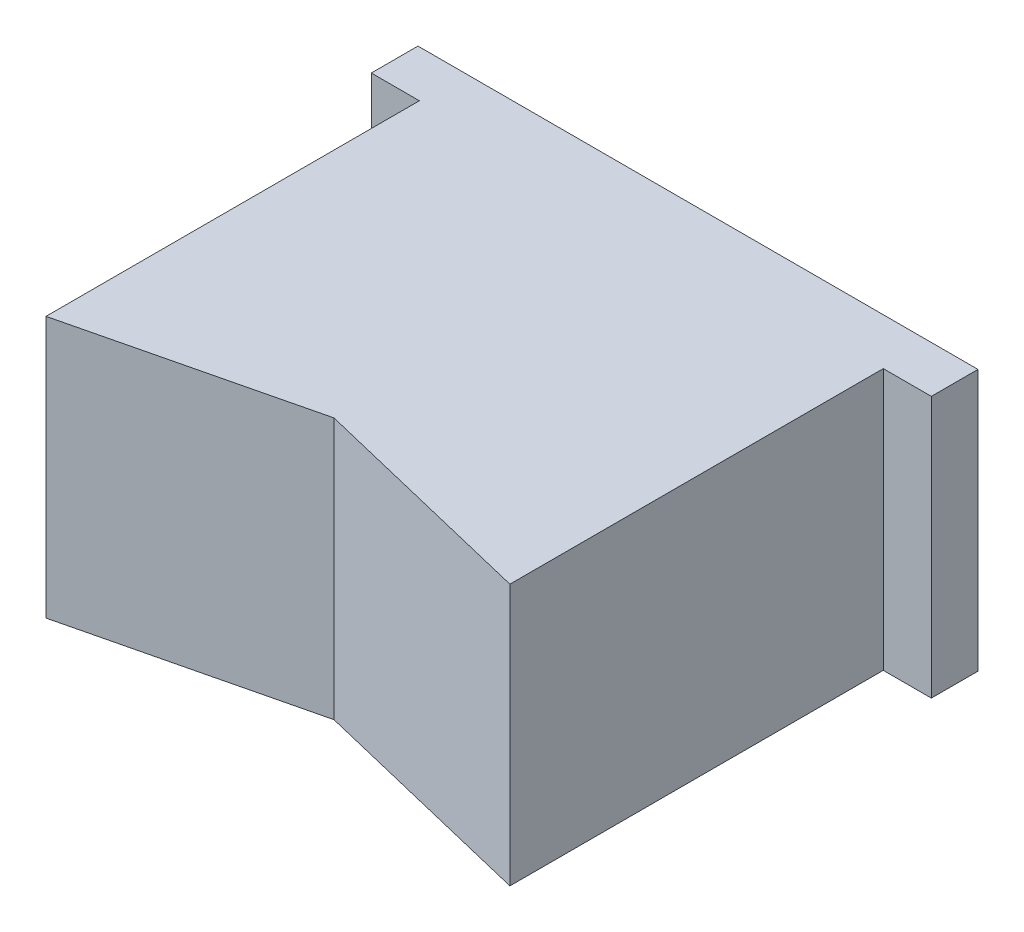
ISO-10303-21;
HEADER;
FILE_DESCRIPTION(('STEP AP214'),'2;1');
FILE_NAME('part.step','',(''),(''),'','','');
FILE_SCHEMA(('AUTOMOTIVE_DESIGN { 1 0 10303 214 1 1 1 1 }'));
ENDSEC;
DATA;
#1=APPLICATION_CONTEXT('core data for automotive mechanical design processes');
#2=APPLICATION_PROTOCOL_DEFINITION('international standard','automotive_design',2000,#1);
#3=PRODUCT_CONTEXT('',#1,'mechanical');
#4=PRODUCT('Part','Part','',(#3));
#5=PRODUCT_RELATED_PRODUCT_CATEGORY('part','',(#4));
#6=PRODUCT_DEFINITION_FORMATION('','',#4);
#7=PRODUCT_DEFINITION_CONTEXT('part definition',#1,'design');
#8=PRODUCT_DEFINITION('design','',#6,#7);
#9=PRODUCT_DEFINITION_SHAPE('','',#8);
#10=(LENGTH_UNIT() NAMED_UNIT(*) SI_UNIT(.MILLI.,.METRE.));
#11=(NAMED_UNIT(*) PLANE_ANGLE_UNIT() SI_UNIT($,.RADIAN.));
#12=(NAMED_UNIT(*) SI_UNIT($,.STERADIAN.) SOLID_ANGLE_UNIT());
#13=UNCERTAINTY_MEASURE_WITH_UNIT(LENGTH_MEASURE(1.E-05),#10,'distance_accuracy_value','');
#14=(GEOMETRIC_REPRESENTATION_CONTEXT(3) GLOBAL_UNCERTAINTY_ASSIGNED_CONTEXT((#13)) GLOBAL_UNIT_ASSIGNED_CONTEXT((#10,
#11,#12)) REPRESENTATION_CONTEXT('',''));
#15=CARTESIAN_POINT('',(0.,0.,0.));
#16=DIRECTION('',(0.,0.,1.));
#17=DIRECTION('',(1.,0.,0.));
#18=AXIS2_PLACEMENT_3D('',#15,#16,#17);
#19=CARTESIAN_POINT('',(0.,0.,2.5));
#20=DIRECTION('',(0.,0.,1.));
#21=DIRECTION('',(1.,0.,0.));
#22=AXIS2_PLACEMENT_3D('',#19,#20,#21);
#23=PLANE('',#22);
#24=DIRECTION('',(0.,1.,0.));
#25=VECTOR('',#24,1.);
#26=CARTESIAN_POINT('',(12.425,7.,2.5));
#27=LINE('',#26,#25);
#28=CARTESIAN_POINT('',(12.425,-7.,2.5));
#29=VERTEX_POINT('',#28);
#30=CARTESIAN_POINT('',(12.425,7.,2.5));
#31=VERTEX_POINT('',#30);
#32=EDGE_CURVE('E48',#29,#31,#27,.T.);
#33=ORIENTED_EDGE('',*,*,#32,.F.);
#34=DIRECTION('',(1.,0.,0.));
#35=VECTOR('',#34,1.);
#36=CARTESIAN_POINT('',(-15.,-7.,2.5));
#37=LINE('',#36,#35);
#38=CARTESIAN_POINT('',(15.,-7.,2.5));
#39=VERTEX_POINT('',#38);
#40=EDGE_CURVE('E156',#29,#39,#37,.T.);
#41=ORIENTED_EDGE('',*,*,#40,.T.);
#42=DIRECTION('',(0.,1.,0.));
#43=VECTOR('',#42,1.);
#44=CARTESIAN_POINT('',(15.,7.,2.5));
#45=LINE('',#44,#43);
#46=CARTESIAN_POINT('',(15.,7.,2.5));
#47=VERTEX_POINT('',#46);
#48=EDGE_CURVE('E147',#39,#47,#45,.T.);
#49=ORIENTED_EDGE('',*,*,#48,.T.);
#50=DIRECTION('',(-1.,0.,0.));
#51=VECTOR('',#50,1.);
#52=CARTESIAN_POINT('',(-15.,7.,2.5));
#53=LINE('',#52,#51);
#54=EDGE_CURVE('E152',#47,#31,#53,.T.);
#55=ORIENTED_EDGE('',*,*,#54,.T.);
#56=EDGE_LOOP('',(#33,#41,#49,#55));
#57=FACE_BOUND('',#56,.T.);
#58=ADVANCED_FACE('F33',(#57),#23,.T.);
#59=CARTESIAN_POINT('',(15.,7.,2.5));
#60=DIRECTION('',(-1.,0.,0.));
#61=DIRECTION('',(0.,-1.,0.));
#62=AXIS2_PLACEMENT_3D('',#59,#60,#61);
#63=PLANE('',#62);
#64=DIRECTION('',(0.,1.,0.));
#65=VECTOR('',#64,1.);
#66=CARTESIAN_POINT('',(15.,7.,0.));
#67=LINE('',#66,#65);
#68=CARTESIAN_POINT('',(15.,-7.,0.));
#69=VERTEX_POINT('',#68);
#70=CARTESIAN_POINT('',(15.,7.,0.));
#71=VERTEX_POINT('',#70);
#72=EDGE_CURVE('E146',#69,#71,#67,.T.);
#73=ORIENTED_EDGE('',*,*,#72,.T.);
#74=DIRECTION('',(0.,0.,-1.));
#75=VECTOR('',#74,1.);
#76=CARTESIAN_POINT('',(15.,7.,2.5));
#77=LINE('',#76,#75);
#78=EDGE_CURVE('E11',#47,#71,#77,.T.);
#79=ORIENTED_EDGE('',*,*,#78,.F.);
#80=ORIENTED_EDGE('',*,*,#48,.F.);
#81=DIRECTION('',(0.,0.,-1.));
#82=VECTOR('',#81,1.);
#83=CARTESIAN_POINT('',(15.,-7.,2.5));
#84=LINE('',#83,#82);
#85=EDGE_CURVE('E159',#39,#69,#84,.T.);
#86=ORIENTED_EDGE('',*,*,#85,.T.);
#87=EDGE_LOOP('',(#73,#79,#80,#86));
#88=FACE_BOUND('',#87,.T.);
#89=ADVANCED_FACE('F35',(#88),#63,.F.);
#90=CARTESIAN_POINT('',(-15.,7.,2.5));
#91=DIRECTION('',(0.,-1.,0.));
#92=DIRECTION('',(0.,0.,-1.));
#93=AXIS2_PLACEMENT_3D('',#90,#91,#92);
#94=PLANE('',#93);
#95=DIRECTION('',(-0.972066823245949,0.,0.234704263157976));
#96=VECTOR('',#95,1.);
#97=CARTESIAN_POINT('',(-12.425,7.,22.5));
#98=LINE('',#97,#96);
#99=CARTESIAN_POINT('',(0.,7.,19.5));
#100=VERTEX_POINT('',#99);
#101=CARTESIAN_POINT('',(-12.425,7.,22.5));
#102=VERTEX_POINT('',#101);
#103=EDGE_CURVE('E107',#100,#102,#98,.T.);
#104=ORIENTED_EDGE('',*,*,#103,.F.);
#105=DIRECTION('',(-0.972066823245949,0.,-0.234704263157976));
#106=VECTOR('',#105,1.);
#107=CARTESIAN_POINT('',(0.,7.,19.5));
#108=LINE('',#107,#106);
#109=CARTESIAN_POINT('',(12.425,7.,22.5));
#110=VERTEX_POINT('',#109);
#111=EDGE_CURVE('E115',#110,#100,#108,.T.);
#112=ORIENTED_EDGE('',*,*,#111,.F.);
#113=DIRECTION('',(0.,0.,-1.));
#114=VECTOR('',#113,1.);
#115=CARTESIAN_POINT('',(12.425,7.,22.5));
#116=LINE('',#115,#114);
#117=EDGE_CURVE('E144',#110,#31,#116,.T.);
#118=ORIENTED_EDGE('',*,*,#117,.T.);
#119=ORIENTED_EDGE('',*,*,#54,.F.);
#120=ORIENTED_EDGE('',*,*,#78,.T.);
#121=DIRECTION('',(-1.,0.,0.));
#122=VECTOR('',#121,1.);
#123=CARTESIAN_POINT('',(-15.,7.,0.));
#124=LINE('',#123,#122);
#125=CARTESIAN_POINT('',(-15.,7.,0.));
#126=VERTEX_POINT('',#125);
#127=EDGE_CURVE('E162',#71,#126,#124,.T.);
#128=ORIENTED_EDGE('',*,*,#127,.T.);
#129=DIRECTION('',(0.,0.,-1.));
#130=VECTOR('',#129,1.);
#131=CARTESIAN_POINT('',(-15.,7.,2.5));
#132=LINE('',#131,#130);
#133=CARTESIAN_POINT('',(-15.,7.,2.5));
#134=VERTEX_POINT('',#133);
#135=EDGE_CURVE('E41',#134,#126,#132,.T.);
#136=ORIENTED_EDGE('',*,*,#135,.F.);
#137=CARTESIAN_POINT('',(-12.425,7.,2.5));
#138=VERTEX_POINT('',#137);
#139=EDGE_CURVE('E150',#138,#134,#53,.T.);
#140=ORIENTED_EDGE('',*,*,#139,.F.);
#141=DIRECTION('',(0.,0.,-1.));
#142=VECTOR('',#141,1.);
#143=CARTESIAN_POINT('',(-12.425,7.,22.5));
#144=LINE('',#143,#142);
#145=EDGE_CURVE('E125',#102,#138,#144,.T.);
#146=ORIENTED_EDGE('',*,*,#145,.F.);
#147=EDGE_LOOP('',(#104,#112,#118,#119,#120,#128,#136,#140,#146));
#148=FACE_BOUND('',#147,.T.);
#149=ADVANCED_FACE('F123',(#148),#94,.F.);
#150=CARTESIAN_POINT('',(-15.,7.,2.5));
#151=DIRECTION('',(1.,0.,0.));
#152=DIRECTION('',(0.,1.,0.));
#153=AXIS2_PLACEMENT_3D('',#150,#151,#152);
#154=PLANE('',#153);
#155=DIRECTION('',(0.,-1.,0.));
#156=VECTOR('',#155,1.);
#157=CARTESIAN_POINT('',(-15.,7.,0.));
#158=LINE('',#157,#156);
#159=CARTESIAN_POINT('',(-15.,-7.,0.));
#160=VERTEX_POINT('',#159);
#161=EDGE_CURVE('E164',#126,#160,#158,.T.);
#162=ORIENTED_EDGE('',*,*,#161,.T.);
#163=DIRECTION('',(0.,0.,-1.));
#164=VECTOR('',#163,1.);
#165=CARTESIAN_POINT('',(-15.,-7.,2.5));
#166=LINE('',#165,#164);
#167=CARTESIAN_POINT('',(-15.,-7.,2.5));
#168=VERTEX_POINT('',#167);
#169=EDGE_CURVE('E169',#168,#160,#166,.T.);
#170=ORIENTED_EDGE('',*,*,#169,.F.);
#171=DIRECTION('',(0.,-1.,0.));
#172=VECTOR('',#171,1.);
#173=CARTESIAN_POINT('',(-15.,7.,2.5));
#174=LINE('',#173,#172);
#175=EDGE_CURVE('E154',#134,#168,#174,.T.);
#176=ORIENTED_EDGE('',*,*,#175,.F.);
#177=ORIENTED_EDGE('',*,*,#135,.T.);
#178=EDGE_LOOP('',(#162,#170,#176,#177));
#179=FACE_BOUND('',#178,.T.);
#180=ADVANCED_FACE('F176',(#179),#154,.F.);
#181=CARTESIAN_POINT('',(-15.,-7.,2.5));
#182=DIRECTION('',(0.,1.,0.));
#183=DIRECTION('',(0.,0.,1.));
#184=AXIS2_PLACEMENT_3D('',#181,#182,#183);
#185=PLANE('',#184);
#186=DIRECTION('',(0.,0.,-1.));
#187=VECTOR('',#186,1.);
#188=CARTESIAN_POINT('',(12.425,-7.,22.5));
#189=LINE('',#188,#187);
#190=CARTESIAN_POINT('',(12.425,-7.,22.5));
#191=VERTEX_POINT('',#190);
#192=EDGE_CURVE('E135',#191,#29,#189,.T.);
#193=ORIENTED_EDGE('',*,*,#192,.F.);
#194=DIRECTION('',(-0.972066823245949,0.,-0.234704263157976));
#195=VECTOR('',#194,1.);
#196=CARTESIAN_POINT('',(-18.0522285001664,-7.,15.1413130381892));
#197=LINE('',#196,#195);
#198=CARTESIAN_POINT('',(0.,-7.,19.5));
#199=VERTEX_POINT('',#198);
#200=EDGE_CURVE('E130',#191,#199,#197,.T.);
#201=ORIENTED_EDGE('',*,*,#200,.T.);
#202=DIRECTION('',(-0.972066823245949,0.,0.234704263157976));
#203=VECTOR('',#202,1.);
#204=CARTESIAN_POINT('',(-10.2951887654977,-7.,21.9857598628968));
#205=LINE('',#204,#203);
#206=CARTESIAN_POINT('',(-12.425,-7.,22.5));
#207=VERTEX_POINT('',#206);
#208=EDGE_CURVE('E110',#199,#207,#205,.T.);
#209=ORIENTED_EDGE('',*,*,#208,.T.);
#210=DIRECTION('',(0.,0.,-1.));
#211=VECTOR('',#210,1.);
#212=CARTESIAN_POINT('',(-12.425,-7.,22.5));
#213=LINE('',#212,#211);
#214=CARTESIAN_POINT('',(-12.425,-7.,2.5));
#215=VERTEX_POINT('',#214);
#216=EDGE_CURVE('E140',#207,#215,#213,.T.);
#217=ORIENTED_EDGE('',*,*,#216,.T.);
#218=EDGE_CURVE('E157',#168,#215,#37,.T.);
#219=ORIENTED_EDGE('',*,*,#218,.F.);
#220=ORIENTED_EDGE('',*,*,#169,.T.);
#221=DIRECTION('',(1.,0.,0.));
#222=VECTOR('',#221,1.);
#223=CARTESIAN_POINT('',(-15.,-7.,0.));
#224=LINE('',#223,#222);
#225=EDGE_CURVE('E151',#160,#69,#224,.T.);
#226=ORIENTED_EDGE('',*,*,#225,.T.);
#227=ORIENTED_EDGE('',*,*,#85,.F.);
#228=ORIENTED_EDGE('',*,*,#40,.F.);
#229=EDGE_LOOP('',(#193,#201,#209,#217,#219,#220,#226,#227,#228));
#230=FACE_BOUND('',#229,.T.);
#231=ADVANCED_FACE('F185',(#230),#185,.F.);
#232=DIRECTION('',(0.,-1.,0.));
#233=VECTOR('',#232,1.);
#234=CARTESIAN_POINT('',(-12.425,7.,2.5));
#235=LINE('',#234,#233);
#236=EDGE_CURVE('E56',#138,#215,#235,.T.);
#237=ORIENTED_EDGE('',*,*,#236,.F.);
#238=ORIENTED_EDGE('',*,*,#139,.T.);
#239=ORIENTED_EDGE('',*,*,#175,.T.);
#240=ORIENTED_EDGE('',*,*,#218,.T.);
#241=EDGE_LOOP('',(#237,#238,#239,#240));
#242=FACE_BOUND('',#241,.T.);
#243=ADVANCED_FACE('F201',(#242),#23,.T.);
#244=CARTESIAN_POINT('',(0.,0.,0.));
#245=DIRECTION('',(0.,0.,1.));
#246=DIRECTION('',(1.,0.,0.));
#247=AXIS2_PLACEMENT_3D('',#244,#245,#246);
#248=PLANE('',#247);
#249=ORIENTED_EDGE('',*,*,#72,.F.);
#250=ORIENTED_EDGE('',*,*,#225,.F.);
#251=ORIENTED_EDGE('',*,*,#161,.F.);
#252=ORIENTED_EDGE('',*,*,#127,.F.);
#253=EDGE_LOOP('',(#249,#250,#251,#252));
#254=FACE_BOUND('',#253,.T.);
#255=ADVANCED_FACE('F181',(#254),#248,.F.);
#256=CARTESIAN_POINT('',(12.425,7.,22.5));
#257=DIRECTION('',(-1.,0.,0.));
#258=DIRECTION('',(0.,-1.,0.));
#259=AXIS2_PLACEMENT_3D('',#256,#257,#258);
#260=PLANE('',#259);
#261=ORIENTED_EDGE('',*,*,#32,.T.);
#262=ORIENTED_EDGE('',*,*,#117,.F.);
#263=DIRECTION('',(0.,1.,0.));
#264=VECTOR('',#263,1.);
#265=CARTESIAN_POINT('',(12.425,7.,22.5));
#266=LINE('',#265,#264);
#267=EDGE_CURVE('E118',#191,#110,#266,.T.);
#268=ORIENTED_EDGE('',*,*,#267,.F.);
#269=ORIENTED_EDGE('',*,*,#192,.T.);
#270=EDGE_LOOP('',(#261,#262,#268,#269));
#271=FACE_BOUND('',#270,.T.);
#272=ADVANCED_FACE('F191',(#271),#260,.F.);
#273=CARTESIAN_POINT('',(-12.425,7.,22.5));
#274=DIRECTION('',(1.,0.,0.));
#275=DIRECTION('',(0.,1.,0.));
#276=AXIS2_PLACEMENT_3D('',#273,#274,#275);
#277=PLANE('',#276);
#278=ORIENTED_EDGE('',*,*,#236,.T.);
#279=ORIENTED_EDGE('',*,*,#216,.F.);
#280=DIRECTION('',(0.,-1.,0.));
#281=VECTOR('',#280,1.);
#282=CARTESIAN_POINT('',(-12.425,7.,22.5));
#283=LINE('',#282,#281);
#284=EDGE_CURVE('E133',#102,#207,#283,.T.);
#285=ORIENTED_EDGE('',*,*,#284,.F.);
#286=ORIENTED_EDGE('',*,*,#145,.T.);
#287=EDGE_LOOP('',(#278,#279,#285,#286));
#288=FACE_BOUND('',#287,.T.);
#289=ADVANCED_FACE('F193',(#288),#277,.F.);
#290=CARTESIAN_POINT('',(0.,-13.,19.5));
#291=DIRECTION('',(0.234704263157976,0.,-0.972066823245949));
#292=DIRECTION('',(-0.972066823245949,0.,-0.234704263157976));
#293=AXIS2_PLACEMENT_3D('',#290,#291,#292);
#294=PLANE('',#293);
#295=ORIENTED_EDGE('',*,*,#267,.T.);
#296=ORIENTED_EDGE('',*,*,#111,.T.);
#297=DIRECTION('',(0.,1.,0.));
#298=VECTOR('',#297,1.);
#299=CARTESIAN_POINT('',(0.,-13.,19.5));
#300=LINE('',#299,#298);
#301=EDGE_CURVE('E103',#199,#100,#300,.T.);
#302=ORIENTED_EDGE('',*,*,#301,.F.);
#303=ORIENTED_EDGE('',*,*,#200,.F.);
#304=EDGE_LOOP('',(#295,#296,#302,#303));
#305=FACE_BOUND('',#304,.T.);
#306=ADVANCED_FACE('F116',(#305),#294,.F.);
#307=CARTESIAN_POINT('',(-12.425,-13.,22.5));
#308=DIRECTION('',(-0.234704263157976,0.,-0.972066823245949));
#309=DIRECTION('',(-0.972066823245949,0.,0.234704263157976));
#310=AXIS2_PLACEMENT_3D('',#307,#308,#309);
#311=PLANE('',#310);
#312=ORIENTED_EDGE('',*,*,#301,.T.);
#313=ORIENTED_EDGE('',*,*,#103,.T.);
#314=ORIENTED_EDGE('',*,*,#284,.T.);
#315=ORIENTED_EDGE('',*,*,#208,.F.);
#316=EDGE_LOOP('',(#312,#313,#314,#315));
#317=FACE_BOUND('',#316,.T.);
#318=ADVANCED_FACE('F105',(#317),#311,.F.);
#319=CLOSED_SHELL('',(#58,#89,#149,#180,#231,#243,#255,#272,#289,#306,#318));
#320=MANIFOLD_SOLID_BREP('B2',#319);
#321=ADVANCED_BREP_SHAPE_REPRESENTATION('',(#18,#320),#14);
#322=SHAPE_DEFINITION_REPRESENTATION(#9,#321);
ENDSEC;
END-ISO-10303-21;
